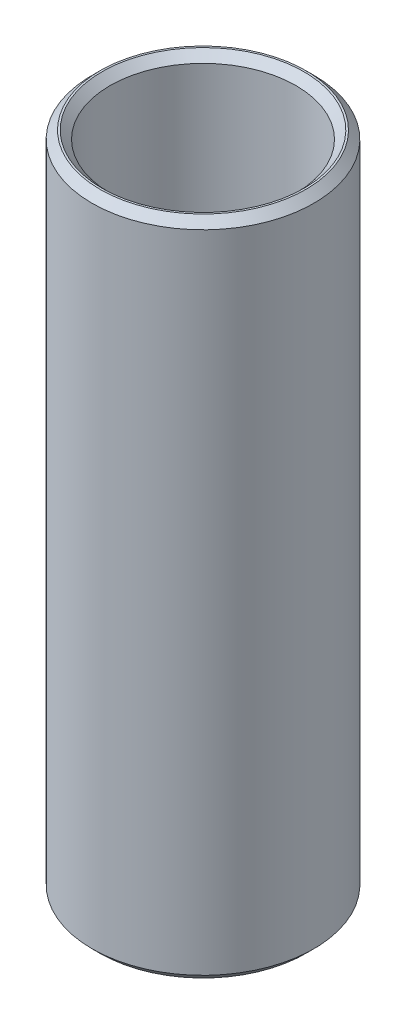
ISO-10303-21;
HEADER;
FILE_DESCRIPTION(('STEP AP214'),'2;1');
FILE_NAME('part.step','',(''),(''),'','','');
FILE_SCHEMA(('AUTOMOTIVE_DESIGN { 1 0 10303 214 1 1 1 1 }'));
ENDSEC;
DATA;
#1=APPLICATION_CONTEXT('core data for automotive mechanical design processes');
#2=APPLICATION_PROTOCOL_DEFINITION('international standard','automotive_design',2000,#1);
#3=PRODUCT_CONTEXT('',#1,'mechanical');
#4=PRODUCT('Part','Part','',(#3));
#5=PRODUCT_RELATED_PRODUCT_CATEGORY('part','',(#4));
#6=PRODUCT_DEFINITION_FORMATION('','',#4);
#7=PRODUCT_DEFINITION_CONTEXT('part definition',#1,'design');
#8=PRODUCT_DEFINITION('design','',#6,#7);
#9=PRODUCT_DEFINITION_SHAPE('','',#8);
#10=(LENGTH_UNIT() NAMED_UNIT(*) SI_UNIT(.MILLI.,.METRE.));
#11=(NAMED_UNIT(*) PLANE_ANGLE_UNIT() SI_UNIT($,.RADIAN.));
#12=(NAMED_UNIT(*) SI_UNIT($,.STERADIAN.) SOLID_ANGLE_UNIT());
#13=UNCERTAINTY_MEASURE_WITH_UNIT(LENGTH_MEASURE(1.E-05),#10,'distance_accuracy_value','');
#14=(GEOMETRIC_REPRESENTATION_CONTEXT(3) GLOBAL_UNCERTAINTY_ASSIGNED_CONTEXT((#13)) GLOBAL_UNIT_ASSIGNED_CONTEXT((#10,
#11,#12)) REPRESENTATION_CONTEXT('',''));
#15=CARTESIAN_POINT('',(0.,0.,0.));
#16=DIRECTION('',(0.,0.,1.));
#17=DIRECTION('',(1.,0.,0.));
#18=AXIS2_PLACEMENT_3D('',#15,#16,#17);
#19=CARTESIAN_POINT('',(0.,208.796272096054,0.));
#20=DIRECTION('',(0.,-1.,0.));
#21=DIRECTION('',(0.,0.,-1.));
#22=AXIS2_PLACEMENT_3D('',#19,#20,#21);
#23=CYLINDRICAL_SURFACE('',#22,35.);
#24=CARTESIAN_POINT('',(0.,2.5273623892739,0.));
#25=DIRECTION('',(0.,1.,0.));
#26=DIRECTION('',(0.,0.,1.));
#27=AXIS2_PLACEMENT_3D('',#24,#25,#26);
#28=CIRCLE('',#27,35.);
#29=CARTESIAN_POINT('',(0.,2.5273623892739,35.));
#30=VERTEX_POINT('',#29);
#31=EDGE_CURVE('E10',#30,#30,#28,.T.);
#32=ORIENTED_EDGE('',*,*,#31,.T.);
#33=EDGE_LOOP('',(#32));
#34=FACE_BOUND('',#33,.T.);
#35=CARTESIAN_POINT('',(0.,206.26890970678,0.));
#36=DIRECTION('',(0.,1.,0.));
#37=DIRECTION('',(0.,0.,1.));
#38=AXIS2_PLACEMENT_3D('',#35,#36,#37);
#39=CIRCLE('',#38,35.);
#40=CARTESIAN_POINT('',(0.,206.26890970678,35.));
#41=VERTEX_POINT('',#40);
#42=EDGE_CURVE('E50',#41,#41,#39,.F.);
#43=ORIENTED_EDGE('',*,*,#42,.T.);
#44=EDGE_LOOP('',(#43));
#45=FACE_BOUND('',#44,.T.);
#46=ADVANCED_FACE('F39',(#34,#45),#23,.T.);
#47=CARTESIAN_POINT('',(0.,208.796272096054,0.));
#48=DIRECTION('',(0.,1.,0.));
#49=DIRECTION('',(0.,0.,1.));
#50=AXIS2_PLACEMENT_3D('',#47,#48,#49);
#51=PLANE('',#50);
#52=CARTESIAN_POINT('',(0.,208.796272096054,0.));
#53=DIRECTION('',(0.,1.,0.));
#54=DIRECTION('',(0.,0.,1.));
#55=AXIS2_PLACEMENT_3D('',#52,#53,#54);
#56=CIRCLE('',#55,31.8733550166155);
#57=CARTESIAN_POINT('',(0.,208.796272096054,31.8733550166155));
#58=VERTEX_POINT('',#57);
#59=EDGE_CURVE('E58',#58,#58,#56,.F.);
#60=ORIENTED_EDGE('',*,*,#59,.T.);
#61=EDGE_LOOP('',(#60));
#62=FACE_BOUND('',#61,.T.);
#63=CARTESIAN_POINT('',(0.,208.796272096054,0.));
#64=DIRECTION('',(0.,1.,0.));
#65=DIRECTION('',(0.,0.,1.));
#66=AXIS2_PLACEMENT_3D('',#63,#64,#65);
#67=CIRCLE('',#66,32.4726376107261);
#68=CARTESIAN_POINT('',(0.,208.796272096054,32.4726376107261));
#69=VERTEX_POINT('',#68);
#70=EDGE_CURVE('E61',#69,#69,#67,.T.);
#71=ORIENTED_EDGE('',*,*,#70,.T.);
#72=EDGE_LOOP('',(#71));
#73=FACE_BOUND('',#72,.T.);
#74=ADVANCED_FACE('F88',(#62,#73),#51,.T.);
#75=CARTESIAN_POINT('',(0.,0.,0.));
#76=DIRECTION('',(0.,1.,0.));
#77=DIRECTION('',(0.,0.,1.));
#78=AXIS2_PLACEMENT_3D('',#75,#76,#77);
#79=PLANE('',#78);
#80=CARTESIAN_POINT('',(0.,0.,0.));
#81=DIRECTION('',(0.,1.,0.));
#82=DIRECTION('',(0.,0.,1.));
#83=AXIS2_PLACEMENT_3D('',#80,#81,#82);
#84=CIRCLE('',#83,31.8733550166155);
#85=CARTESIAN_POINT('',(0.,0.,31.8733550166155));
#86=VERTEX_POINT('',#85);
#87=EDGE_CURVE('E51',#86,#86,#84,.T.);
#88=ORIENTED_EDGE('',*,*,#87,.T.);
#89=EDGE_LOOP('',(#88));
#90=FACE_BOUND('',#89,.T.);
#91=CARTESIAN_POINT('',(0.,0.,0.));
#92=DIRECTION('',(0.,1.,0.));
#93=DIRECTION('',(0.,0.,1.));
#94=AXIS2_PLACEMENT_3D('',#91,#92,#93);
#95=CIRCLE('',#94,32.4726376107261);
#96=CARTESIAN_POINT('',(0.,0.,32.4726376107261));
#97=VERTEX_POINT('',#96);
#98=EDGE_CURVE('E54',#97,#97,#95,.F.);
#99=ORIENTED_EDGE('',*,*,#98,.T.);
#100=EDGE_LOOP('',(#99));
#101=FACE_BOUND('',#100,.T.);
#102=ADVANCED_FACE('F83',(#90,#101),#79,.F.);
#103=CARTESIAN_POINT('',(0.,208.796272096054,0.));
#104=DIRECTION('',(0.,-1.,0.));
#105=DIRECTION('',(0.,0.,-1.));
#106=AXIS2_PLACEMENT_3D('',#103,#104,#105);
#107=CYLINDRICAL_SURFACE('',#106,29.3459926273416);
#108=CARTESIAN_POINT('',(0.,206.26890970678,0.));
#109=DIRECTION('',(0.,1.,0.));
#110=DIRECTION('',(0.,0.,1.));
#111=AXIS2_PLACEMENT_3D('',#108,#109,#110);
#112=CIRCLE('',#111,29.3459926273416);
#113=CARTESIAN_POINT('',(0.,206.26890970678,29.3459926273416));
#114=VERTEX_POINT('',#113);
#115=EDGE_CURVE('E67',#114,#114,#112,.T.);
#116=ORIENTED_EDGE('',*,*,#115,.T.);
#117=EDGE_LOOP('',(#116));
#118=FACE_BOUND('',#117,.T.);
#119=CARTESIAN_POINT('',(0.,2.52736238927392,0.));
#120=DIRECTION('',(0.,1.,0.));
#121=DIRECTION('',(0.,0.,1.));
#122=AXIS2_PLACEMENT_3D('',#119,#120,#121);
#123=CIRCLE('',#122,29.3459926273416);
#124=CARTESIAN_POINT('',(0.,2.52736238927392,29.3459926273416));
#125=VERTEX_POINT('',#124);
#126=EDGE_CURVE('E69',#125,#125,#123,.F.);
#127=ORIENTED_EDGE('',*,*,#126,.T.);
#128=EDGE_LOOP('',(#127));
#129=FACE_BOUND('',#128,.T.);
#130=ADVANCED_FACE('F71',(#118,#129),#107,.F.);
#131=CARTESIAN_POINT('',(0.,206.26890970678,0.));
#132=DIRECTION('',(0.,1.,0.));
#133=DIRECTION('',(0.,0.,1.));
#134=AXIS2_PLACEMENT_3D('',#131,#132,#133);
#135=CONICAL_SURFACE('',#134,29.3459926273416,0.785398163397446);
#136=ORIENTED_EDGE('',*,*,#59,.F.);
#137=EDGE_LOOP('',(#136));
#138=FACE_BOUND('',#137,.T.);
#139=ORIENTED_EDGE('',*,*,#115,.F.);
#140=EDGE_LOOP('',(#139));
#141=FACE_BOUND('',#140,.T.);
#142=ADVANCED_FACE('F77',(#138,#141),#135,.F.);
#143=CARTESIAN_POINT('',(0.,0.,0.));
#144=DIRECTION('',(0.,-1.,0.));
#145=DIRECTION('',(0.,0.,-1.));
#146=AXIS2_PLACEMENT_3D('',#143,#144,#145);
#147=CONICAL_SURFACE('',#146,31.8733550166155,0.785398163397446);
#148=ORIENTED_EDGE('',*,*,#126,.F.);
#149=EDGE_LOOP('',(#148));
#150=FACE_BOUND('',#149,.T.);
#151=ORIENTED_EDGE('',*,*,#87,.F.);
#152=EDGE_LOOP('',(#151));
#153=FACE_BOUND('',#152,.T.);
#154=ADVANCED_FACE('F73',(#150,#153),#147,.F.);
#155=CARTESIAN_POINT('',(0.,2.5273623892739,0.));
#156=DIRECTION('',(0.,1.,0.));
#157=DIRECTION('',(0.,0.,1.));
#158=AXIS2_PLACEMENT_3D('',#155,#156,#157);
#159=CONICAL_SURFACE('',#158,35.,0.785398163397444);
#160=ORIENTED_EDGE('',*,*,#98,.F.);
#161=EDGE_LOOP('',(#160));
#162=FACE_BOUND('',#161,.T.);
#163=ORIENTED_EDGE('',*,*,#31,.F.);
#164=EDGE_LOOP('',(#163));
#165=FACE_BOUND('',#164,.T.);
#166=ADVANCED_FACE('F76',(#162,#165),#159,.T.);
#167=CARTESIAN_POINT('',(0.,208.796272096054,0.));
#168=DIRECTION('',(0.,-1.,0.));
#169=DIRECTION('',(0.,0.,-1.));
#170=AXIS2_PLACEMENT_3D('',#167,#168,#169);
#171=CONICAL_SURFACE('',#170,32.4726376107261,0.78539816339745);
#172=ORIENTED_EDGE('',*,*,#42,.F.);
#173=EDGE_LOOP('',(#172));
#174=FACE_BOUND('',#173,.T.);
#175=ORIENTED_EDGE('',*,*,#70,.F.);
#176=EDGE_LOOP('',(#175));
#177=FACE_BOUND('',#176,.T.);
#178=ADVANCED_FACE('F45',(#174,#177),#171,.T.);
#179=CLOSED_SHELL('',(#46,#74,#102,#130,#142,#154,#166,#178));
#180=MANIFOLD_SOLID_BREP('B2',#179);
#181=ADVANCED_BREP_SHAPE_REPRESENTATION('',(#18,#180),#14);
#182=SHAPE_DEFINITION_REPRESENTATION(#9,#181);
ENDSEC;
END-ISO-10303-21;
